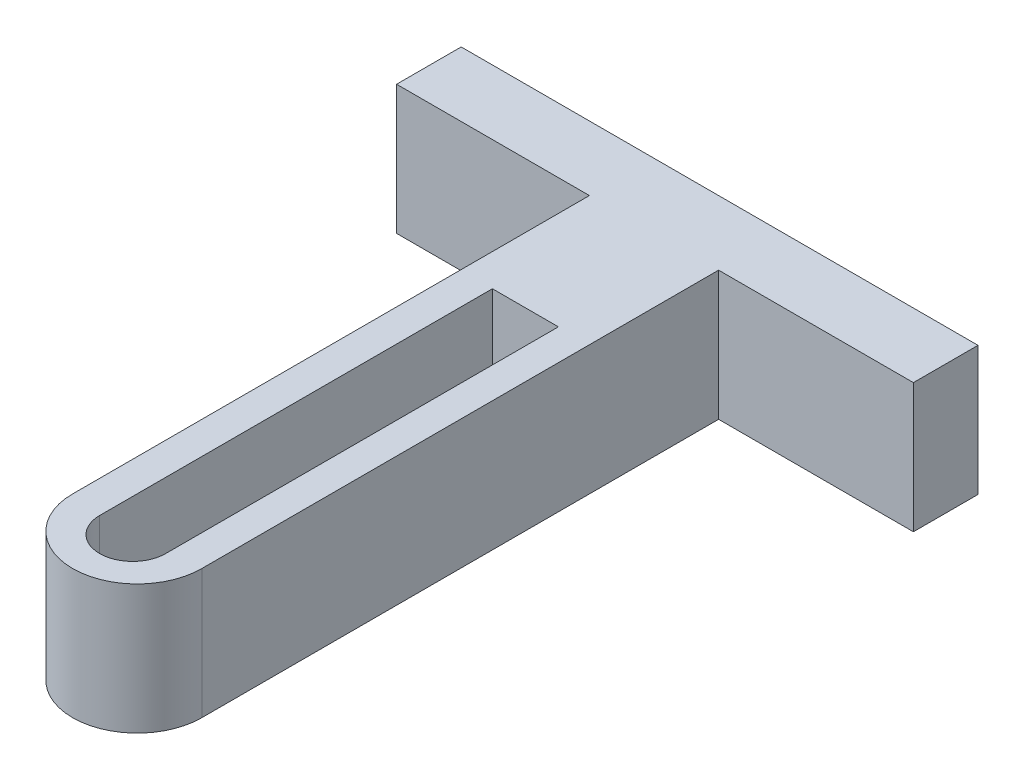
ISO-10303-21;
HEADER;
FILE_DESCRIPTION(('STEP AP214'),'2;1');
FILE_NAME('part.step','',(''),(''),'','','');
FILE_SCHEMA(('AUTOMOTIVE_DESIGN { 1 0 10303 214 1 1 1 1 }'));
ENDSEC;
DATA;
#1=APPLICATION_CONTEXT('core data for automotive mechanical design processes');
#2=APPLICATION_PROTOCOL_DEFINITION('international standard','automotive_design',2000,#1);
#3=PRODUCT_CONTEXT('',#1,'mechanical');
#4=PRODUCT('Part','Part','',(#3));
#5=PRODUCT_RELATED_PRODUCT_CATEGORY('part','',(#4));
#6=PRODUCT_DEFINITION_FORMATION('','',#4);
#7=PRODUCT_DEFINITION_CONTEXT('part definition',#1,'design');
#8=PRODUCT_DEFINITION('design','',#6,#7);
#9=PRODUCT_DEFINITION_SHAPE('','',#8);
#10=(LENGTH_UNIT() NAMED_UNIT(*) SI_UNIT(.MILLI.,.METRE.));
#11=(NAMED_UNIT(*) PLANE_ANGLE_UNIT() SI_UNIT($,.RADIAN.));
#12=(NAMED_UNIT(*) SI_UNIT($,.STERADIAN.) SOLID_ANGLE_UNIT());
#13=UNCERTAINTY_MEASURE_WITH_UNIT(LENGTH_MEASURE(1.E-05),#10,'distance_accuracy_value','');
#14=(GEOMETRIC_REPRESENTATION_CONTEXT(3) GLOBAL_UNCERTAINTY_ASSIGNED_CONTEXT((#13)) GLOBAL_UNIT_ASSIGNED_CONTEXT((#10,
#11,#12)) REPRESENTATION_CONTEXT('',''));
#15=CARTESIAN_POINT('',(0.,0.,0.));
#16=DIRECTION('',(0.,0.,1.));
#17=DIRECTION('',(1.,0.,0.));
#18=AXIS2_PLACEMENT_3D('',#15,#16,#17);
#19=CARTESIAN_POINT('',(0.,0.,6.35));
#20=DIRECTION('',(0.,0.,-1.));
#21=DIRECTION('',(-1.,0.,0.));
#22=AXIS2_PLACEMENT_3D('',#19,#20,#21);
#23=PLANE('',#22);
#24=DIRECTION('',(0.,-1.,0.));
#25=VECTOR('',#24,1.);
#26=CARTESIAN_POINT('',(18.9534844907885,12.7,6.35));
#27=LINE('',#26,#25);
#28=CARTESIAN_POINT('',(18.9534844907885,12.7,6.35));
#29=VERTEX_POINT('',#28);
#30=CARTESIAN_POINT('',(18.9534844907885,0.,6.35));
#31=VERTEX_POINT('',#30);
#32=EDGE_CURVE('E186',#29,#31,#27,.T.);
#33=ORIENTED_EDGE('',*,*,#32,.F.);
#34=DIRECTION('',(-1.,0.,0.));
#35=VECTOR('',#34,1.);
#36=CARTESIAN_POINT('',(0.,12.7,6.35));
#37=LINE('',#36,#35);
#38=CARTESIAN_POINT('',(0.,12.7,6.35));
#39=VERTEX_POINT('',#38);
#40=EDGE_CURVE('E58',#29,#39,#37,.T.);
#41=ORIENTED_EDGE('',*,*,#40,.T.);
#42=DIRECTION('',(0.,-1.,0.));
#43=VECTOR('',#42,1.);
#44=CARTESIAN_POINT('',(0.,0.,6.35));
#45=LINE('',#44,#43);
#46=CARTESIAN_POINT('',(0.,0.,6.35));
#47=VERTEX_POINT('',#46);
#48=EDGE_CURVE('E199',#39,#47,#45,.T.);
#49=ORIENTED_EDGE('',*,*,#48,.T.);
#50=DIRECTION('',(1.,0.,0.));
#51=VECTOR('',#50,1.);
#52=CARTESIAN_POINT('',(0.,0.,6.35));
#53=LINE('',#52,#51);
#54=EDGE_CURVE('E87',#47,#31,#53,.T.);
#55=ORIENTED_EDGE('',*,*,#54,.T.);
#56=EDGE_LOOP('',(#33,#41,#49,#55));
#57=FACE_BOUND('',#56,.T.);
#58=ADVANCED_FACE('F34',(#57),#23,.F.);
#59=CARTESIAN_POINT('',(0.,0.,6.35));
#60=DIRECTION('',(1.,0.,0.));
#61=DIRECTION('',(0.,0.,-1.));
#62=AXIS2_PLACEMENT_3D('',#59,#60,#61);
#63=PLANE('',#62);
#64=DIRECTION('',(0.,-1.,0.));
#65=VECTOR('',#64,1.);
#66=CARTESIAN_POINT('',(0.,0.,0.));
#67=LINE('',#66,#65);
#68=CARTESIAN_POINT('',(0.,12.7,0.));
#69=VERTEX_POINT('',#68);
#70=CARTESIAN_POINT('',(0.,0.,0.));
#71=VERTEX_POINT('',#70);
#72=EDGE_CURVE('E193',#69,#71,#67,.T.);
#73=ORIENTED_EDGE('',*,*,#72,.T.);
#74=DIRECTION('',(0.,0.,-1.));
#75=VECTOR('',#74,1.);
#76=CARTESIAN_POINT('',(0.,0.,6.35));
#77=LINE('',#76,#75);
#78=EDGE_CURVE('E11',#47,#71,#77,.T.);
#79=ORIENTED_EDGE('',*,*,#78,.F.);
#80=ORIENTED_EDGE('',*,*,#48,.F.);
#81=DIRECTION('',(0.,0.,-1.));
#82=VECTOR('',#81,1.);
#83=CARTESIAN_POINT('',(0.,12.7,6.35));
#84=LINE('',#83,#82);
#85=EDGE_CURVE('E208',#39,#69,#84,.T.);
#86=ORIENTED_EDGE('',*,*,#85,.T.);
#87=EDGE_LOOP('',(#73,#79,#80,#86));
#88=FACE_BOUND('',#87,.T.);
#89=ADVANCED_FACE('F36',(#88),#63,.F.);
#90=CARTESIAN_POINT('',(0.,0.,6.35));
#91=DIRECTION('',(0.,1.,0.));
#92=DIRECTION('',(0.,0.,1.));
#93=AXIS2_PLACEMENT_3D('',#90,#91,#92);
#94=PLANE('',#93);
#95=DIRECTION('',(1.,0.,0.));
#96=VECTOR('',#95,1.);
#97=CARTESIAN_POINT('',(0.,0.,0.));
#98=LINE('',#97,#96);
#99=CARTESIAN_POINT('',(50.8,0.,0.));
#100=VERTEX_POINT('',#99);
#101=EDGE_CURVE('E211',#71,#100,#98,.T.);
#102=ORIENTED_EDGE('',*,*,#101,.T.);
#103=DIRECTION('',(0.,0.,-1.));
#104=VECTOR('',#103,1.);
#105=CARTESIAN_POINT('',(50.8,0.,6.35));
#106=LINE('',#105,#104);
#107=CARTESIAN_POINT('',(50.8,0.,6.35));
#108=VERTEX_POINT('',#107);
#109=EDGE_CURVE('E42',#108,#100,#106,.T.);
#110=ORIENTED_EDGE('',*,*,#109,.F.);
#111=CARTESIAN_POINT('',(31.6534844907885,0.,6.35));
#112=VERTEX_POINT('',#111);
#113=EDGE_CURVE('E201',#112,#108,#53,.T.);
#114=ORIENTED_EDGE('',*,*,#113,.F.);
#115=DIRECTION('',(0.,0.,1.));
#116=VECTOR('',#115,1.);
#117=CARTESIAN_POINT('',(31.6534844907885,0.,6.35));
#118=LINE('',#117,#116);
#119=CARTESIAN_POINT('',(31.6534844907885,0.,57.15));
#120=VERTEX_POINT('',#119);
#121=EDGE_CURVE('E49',#112,#120,#118,.T.);
#122=ORIENTED_EDGE('',*,*,#121,.T.);
#123=CARTESIAN_POINT('',(25.3034844907885,0.,57.15));
#124=DIRECTION('',(0.,-1.,0.));
#125=DIRECTION('',(0.,0.,1.));
#126=AXIS2_PLACEMENT_3D('',#123,#124,#125);
#127=CIRCLE('',#126,6.35);
#128=CARTESIAN_POINT('',(18.9534844907885,0.,57.15));
#129=VERTEX_POINT('',#128);
#130=EDGE_CURVE('E180',#120,#129,#127,.T.);
#131=ORIENTED_EDGE('',*,*,#130,.T.);
#132=DIRECTION('',(0.,0.,-1.));
#133=VECTOR('',#132,1.);
#134=CARTESIAN_POINT('',(18.9534844907885,0.,6.35));
#135=LINE('',#134,#133);
#136=EDGE_CURVE('E173',#129,#31,#135,.T.);
#137=ORIENTED_EDGE('',*,*,#136,.T.);
#138=ORIENTED_EDGE('',*,*,#54,.F.);
#139=ORIENTED_EDGE('',*,*,#78,.T.);
#140=EDGE_LOOP('',(#102,#110,#114,#122,#131,#137,#138,#139));
#141=FACE_BOUND('',#140,.T.);
#142=DIRECTION('',(0.,0.,-1.));
#143=VECTOR('',#142,1.);
#144=CARTESIAN_POINT('',(22.1173265244832,0.,57.6532760296239));
#145=LINE('',#144,#143);
#146=CARTESIAN_POINT('',(22.1173265244832,0.,57.6532760296239));
#147=VERTEX_POINT('',#146);
#148=CARTESIAN_POINT('',(22.1173265244832,0.,19.05));
#149=VERTEX_POINT('',#148);
#150=EDGE_CURVE('E167',#147,#149,#145,.T.);
#151=ORIENTED_EDGE('',*,*,#150,.F.);
#152=CARTESIAN_POINT('',(25.3614055076357,0.,57.6532760296239));
#153=DIRECTION('',(0.,-1.,0.));
#154=DIRECTION('',(0.,0.,1.));
#155=AXIS2_PLACEMENT_3D('',#152,#153,#154);
#156=CIRCLE('',#155,3.24407898315258);
#157=CARTESIAN_POINT('',(28.6054844907883,0.,57.6532760296239));
#158=VERTEX_POINT('',#157);
#159=EDGE_CURVE('E141',#158,#147,#156,.T.);
#160=ORIENTED_EDGE('',*,*,#159,.F.);
#161=DIRECTION('',(0.,0.,1.));
#162=VECTOR('',#161,1.);
#163=CARTESIAN_POINT('',(28.6054844907883,0.,57.6532760296239));
#164=LINE('',#163,#162);
#165=CARTESIAN_POINT('',(28.6054844907883,0.,19.05));
#166=VERTEX_POINT('',#165);
#167=EDGE_CURVE('E158',#166,#158,#164,.T.);
#168=ORIENTED_EDGE('',*,*,#167,.F.);
#169=DIRECTION('',(1.,0.,0.));
#170=VECTOR('',#169,1.);
#171=CARTESIAN_POINT('',(22.1173265244832,0.,19.05));
#172=LINE('',#171,#170);
#173=EDGE_CURVE('E161',#149,#166,#172,.T.);
#174=ORIENTED_EDGE('',*,*,#173,.F.);
#175=EDGE_LOOP('',(#151,#160,#168,#174));
#176=FACE_BOUND('',#175,.T.);
#177=ADVANCED_FACE('F244',(#141,#176),#94,.F.);
#178=CARTESIAN_POINT('',(50.8,0.,6.35));
#179=DIRECTION('',(-1.,0.,0.));
#180=DIRECTION('',(0.,0.,1.));
#181=AXIS2_PLACEMENT_3D('',#178,#179,#180);
#182=PLANE('',#181);
#183=DIRECTION('',(0.,1.,0.));
#184=VECTOR('',#183,1.);
#185=CARTESIAN_POINT('',(50.8,0.,0.));
#186=LINE('',#185,#184);
#187=CARTESIAN_POINT('',(50.8,12.7,0.));
#188=VERTEX_POINT('',#187);
#189=EDGE_CURVE('E213',#100,#188,#186,.T.);
#190=ORIENTED_EDGE('',*,*,#189,.T.);
#191=DIRECTION('',(0.,0.,-1.));
#192=VECTOR('',#191,1.);
#193=CARTESIAN_POINT('',(50.8,12.7,6.35));
#194=LINE('',#193,#192);
#195=CARTESIAN_POINT('',(50.8,12.7,6.35));
#196=VERTEX_POINT('',#195);
#197=EDGE_CURVE('E217',#196,#188,#194,.T.);
#198=ORIENTED_EDGE('',*,*,#197,.F.);
#199=DIRECTION('',(0.,1.,0.));
#200=VECTOR('',#199,1.);
#201=CARTESIAN_POINT('',(50.8,0.,6.35));
#202=LINE('',#201,#200);
#203=EDGE_CURVE('E203',#108,#196,#202,.T.);
#204=ORIENTED_EDGE('',*,*,#203,.F.);
#205=ORIENTED_EDGE('',*,*,#109,.T.);
#206=EDGE_LOOP('',(#190,#198,#204,#205));
#207=FACE_BOUND('',#206,.T.);
#208=ADVANCED_FACE('F223',(#207),#182,.F.);
#209=CARTESIAN_POINT('',(0.,12.7,6.35));
#210=DIRECTION('',(0.,-1.,0.));
#211=DIRECTION('',(0.,0.,-1.));
#212=AXIS2_PLACEMENT_3D('',#209,#210,#211);
#213=PLANE('',#212);
#214=DIRECTION('',(-1.,0.,0.));
#215=VECTOR('',#214,1.);
#216=CARTESIAN_POINT('',(0.,12.7,0.));
#217=LINE('',#216,#215);
#218=EDGE_CURVE('E80',#188,#69,#217,.T.);
#219=ORIENTED_EDGE('',*,*,#218,.T.);
#220=ORIENTED_EDGE('',*,*,#85,.F.);
#221=ORIENTED_EDGE('',*,*,#40,.F.);
#222=DIRECTION('',(0.,0.,-1.));
#223=VECTOR('',#222,1.);
#224=CARTESIAN_POINT('',(18.9534844907885,12.7,6.35));
#225=LINE('',#224,#223);
#226=CARTESIAN_POINT('',(18.9534844907885,12.7,57.15));
#227=VERTEX_POINT('',#226);
#228=EDGE_CURVE('E177',#227,#29,#225,.T.);
#229=ORIENTED_EDGE('',*,*,#228,.F.);
#230=CARTESIAN_POINT('',(25.3034844907885,12.7,57.15));
#231=DIRECTION('',(0.,-1.,0.));
#232=DIRECTION('',(0.,0.,1.));
#233=AXIS2_PLACEMENT_3D('',#230,#231,#232);
#234=CIRCLE('',#233,6.35);
#235=CARTESIAN_POINT('',(31.6534844907885,12.7,57.15));
#236=VERTEX_POINT('',#235);
#237=EDGE_CURVE('E183',#236,#227,#234,.T.);
#238=ORIENTED_EDGE('',*,*,#237,.F.);
#239=DIRECTION('',(0.,0.,1.));
#240=VECTOR('',#239,1.);
#241=CARTESIAN_POINT('',(31.6534844907885,12.7,6.35));
#242=LINE('',#241,#240);
#243=CARTESIAN_POINT('',(31.6534844907885,12.7,6.35));
#244=VERTEX_POINT('',#243);
#245=EDGE_CURVE('E179',#244,#236,#242,.T.);
#246=ORIENTED_EDGE('',*,*,#245,.F.);
#247=EDGE_CURVE('E205',#196,#244,#37,.T.);
#248=ORIENTED_EDGE('',*,*,#247,.F.);
#249=ORIENTED_EDGE('',*,*,#197,.T.);
#250=EDGE_LOOP('',(#219,#220,#221,#229,#238,#246,#248,#249));
#251=FACE_BOUND('',#250,.T.);
#252=CARTESIAN_POINT('',(25.3614055076357,12.7,57.6532760296239));
#253=DIRECTION('',(0.,-1.,0.));
#254=DIRECTION('',(0.,0.,1.));
#255=AXIS2_PLACEMENT_3D('',#252,#253,#254);
#256=CIRCLE('',#255,3.24407898315258);
#257=CARTESIAN_POINT('',(28.6054844907883,12.7,57.6532760296239));
#258=VERTEX_POINT('',#257);
#259=CARTESIAN_POINT('',(22.1173265244832,12.7,57.6532760296239));
#260=VERTEX_POINT('',#259);
#261=EDGE_CURVE('E138',#258,#260,#256,.T.);
#262=ORIENTED_EDGE('',*,*,#261,.T.);
#263=DIRECTION('',(0.,0.,-1.));
#264=VECTOR('',#263,1.);
#265=CARTESIAN_POINT('',(22.1173265244832,12.7,57.6532760296239));
#266=LINE('',#265,#264);
#267=CARTESIAN_POINT('',(22.1173265244832,12.7,19.05));
#268=VERTEX_POINT('',#267);
#269=EDGE_CURVE('E150',#260,#268,#266,.T.);
#270=ORIENTED_EDGE('',*,*,#269,.T.);
#271=DIRECTION('',(1.,0.,0.));
#272=VECTOR('',#271,1.);
#273=CARTESIAN_POINT('',(22.1173265244832,12.7,19.05));
#274=LINE('',#273,#272);
#275=CARTESIAN_POINT('',(28.6054844907883,12.7,19.05));
#276=VERTEX_POINT('',#275);
#277=EDGE_CURVE('E154',#268,#276,#274,.T.);
#278=ORIENTED_EDGE('',*,*,#277,.T.);
#279=DIRECTION('',(0.,0.,1.));
#280=VECTOR('',#279,1.);
#281=CARTESIAN_POINT('',(28.6054844907883,12.7,57.6532760296239));
#282=LINE('',#281,#280);
#283=EDGE_CURVE('E146',#276,#258,#282,.T.);
#284=ORIENTED_EDGE('',*,*,#283,.T.);
#285=EDGE_LOOP('',(#262,#270,#278,#284));
#286=FACE_BOUND('',#285,.T.);
#287=ADVANCED_FACE('F156',(#251,#286),#213,.F.);
#288=ORIENTED_EDGE('',*,*,#247,.T.);
#289=DIRECTION('',(0.,-1.,0.));
#290=VECTOR('',#289,1.);
#291=CARTESIAN_POINT('',(31.6534844907885,12.7,6.35));
#292=LINE('',#291,#290);
#293=EDGE_CURVE('E196',#244,#112,#292,.T.);
#294=ORIENTED_EDGE('',*,*,#293,.T.);
#295=ORIENTED_EDGE('',*,*,#113,.T.);
#296=ORIENTED_EDGE('',*,*,#203,.T.);
#297=EDGE_LOOP('',(#288,#294,#295,#296));
#298=FACE_BOUND('',#297,.T.);
#299=ADVANCED_FACE('F243',(#298),#23,.F.);
#300=CARTESIAN_POINT('',(0.,0.,0.));
#301=DIRECTION('',(0.,0.,-1.));
#302=DIRECTION('',(-1.,0.,0.));
#303=AXIS2_PLACEMENT_3D('',#300,#301,#302);
#304=PLANE('',#303);
#305=ORIENTED_EDGE('',*,*,#72,.F.);
#306=ORIENTED_EDGE('',*,*,#218,.F.);
#307=ORIENTED_EDGE('',*,*,#189,.F.);
#308=ORIENTED_EDGE('',*,*,#101,.F.);
#309=EDGE_LOOP('',(#305,#306,#307,#308));
#310=FACE_BOUND('',#309,.T.);
#311=ADVANCED_FACE('F228',(#310),#304,.T.);
#312=CARTESIAN_POINT('',(18.9534844907885,12.7,6.35));
#313=DIRECTION('',(-1.,0.,0.));
#314=DIRECTION('',(0.,0.,1.));
#315=AXIS2_PLACEMENT_3D('',#312,#313,#314);
#316=PLANE('',#315);
#317=ORIENTED_EDGE('',*,*,#136,.F.);
#318=DIRECTION('',(0.,-1.,0.));
#319=VECTOR('',#318,1.);
#320=CARTESIAN_POINT('',(18.9534844907885,12.7,57.15));
#321=LINE('',#320,#319);
#322=EDGE_CURVE('E191',#227,#129,#321,.T.);
#323=ORIENTED_EDGE('',*,*,#322,.F.);
#324=ORIENTED_EDGE('',*,*,#228,.T.);
#325=ORIENTED_EDGE('',*,*,#32,.T.);
#326=EDGE_LOOP('',(#317,#323,#324,#325));
#327=FACE_BOUND('',#326,.T.);
#328=ADVANCED_FACE('F246',(#327),#316,.T.);
#329=CARTESIAN_POINT('',(25.3034844907885,12.7,57.15));
#330=DIRECTION('',(0.,-1.,0.));
#331=DIRECTION('',(0.,0.,-1.));
#332=AXIS2_PLACEMENT_3D('',#329,#330,#331);
#333=CYLINDRICAL_SURFACE('',#332,6.35);
#334=ORIENTED_EDGE('',*,*,#130,.F.);
#335=DIRECTION('',(0.,-1.,0.));
#336=VECTOR('',#335,1.);
#337=CARTESIAN_POINT('',(31.6534844907885,12.7,57.15));
#338=LINE('',#337,#336);
#339=EDGE_CURVE('E194',#236,#120,#338,.T.);
#340=ORIENTED_EDGE('',*,*,#339,.F.);
#341=ORIENTED_EDGE('',*,*,#237,.T.);
#342=ORIENTED_EDGE('',*,*,#322,.T.);
#343=EDGE_LOOP('',(#334,#340,#341,#342));
#344=FACE_BOUND('',#343,.T.);
#345=ADVANCED_FACE('F238',(#344),#333,.T.);
#346=CARTESIAN_POINT('',(31.6534844907885,12.7,6.35));
#347=DIRECTION('',(1.,0.,0.));
#348=DIRECTION('',(0.,0.,-1.));
#349=AXIS2_PLACEMENT_3D('',#346,#347,#348);
#350=PLANE('',#349);
#351=ORIENTED_EDGE('',*,*,#121,.F.);
#352=ORIENTED_EDGE('',*,*,#293,.F.);
#353=ORIENTED_EDGE('',*,*,#245,.T.);
#354=ORIENTED_EDGE('',*,*,#339,.T.);
#355=EDGE_LOOP('',(#351,#352,#353,#354));
#356=FACE_BOUND('',#355,.T.);
#357=ADVANCED_FACE('F240',(#356),#350,.T.);
#358=CARTESIAN_POINT('',(25.3614055076357,12.7,57.6532760296239));
#359=DIRECTION('',(0.,-1.,0.));
#360=DIRECTION('',(0.,0.,-1.));
#361=AXIS2_PLACEMENT_3D('',#358,#359,#360);
#362=CYLINDRICAL_SURFACE('',#361,3.24407898315258);
#363=ORIENTED_EDGE('',*,*,#159,.T.);
#364=DIRECTION('',(0.,-1.,0.));
#365=VECTOR('',#364,1.);
#366=CARTESIAN_POINT('',(22.1173265244832,12.7,57.6532760296239));
#367=LINE('',#366,#365);
#368=EDGE_CURVE('E134',#260,#147,#367,.T.);
#369=ORIENTED_EDGE('',*,*,#368,.F.);
#370=ORIENTED_EDGE('',*,*,#261,.F.);
#371=DIRECTION('',(0.,-1.,0.));
#372=VECTOR('',#371,1.);
#373=CARTESIAN_POINT('',(28.6054844907883,12.7,57.6532760296239));
#374=LINE('',#373,#372);
#375=EDGE_CURVE('E171',#258,#158,#374,.T.);
#376=ORIENTED_EDGE('',*,*,#375,.T.);
#377=EDGE_LOOP('',(#363,#369,#370,#376));
#378=FACE_BOUND('',#377,.T.);
#379=ADVANCED_FACE('F136',(#378),#362,.F.);
#380=CARTESIAN_POINT('',(28.6054844907883,12.7,57.6532760296239));
#381=DIRECTION('',(1.,0.,0.));
#382=DIRECTION('',(0.,0.,-1.));
#383=AXIS2_PLACEMENT_3D('',#380,#381,#382);
#384=PLANE('',#383);
#385=ORIENTED_EDGE('',*,*,#167,.T.);
#386=ORIENTED_EDGE('',*,*,#375,.F.);
#387=ORIENTED_EDGE('',*,*,#283,.F.);
#388=DIRECTION('',(0.,-1.,0.));
#389=VECTOR('',#388,1.);
#390=CARTESIAN_POINT('',(28.6054844907883,12.7,19.05));
#391=LINE('',#390,#389);
#392=EDGE_CURVE('E174',#276,#166,#391,.T.);
#393=ORIENTED_EDGE('',*,*,#392,.T.);
#394=EDGE_LOOP('',(#385,#386,#387,#393));
#395=FACE_BOUND('',#394,.T.);
#396=ADVANCED_FACE('F329',(#395),#384,.F.);
#397=CARTESIAN_POINT('',(22.1173265244832,12.7,19.05));
#398=DIRECTION('',(0.,0.,-1.));
#399=DIRECTION('',(-1.,0.,0.));
#400=AXIS2_PLACEMENT_3D('',#397,#398,#399);
#401=PLANE('',#400);
#402=ORIENTED_EDGE('',*,*,#173,.T.);
#403=ORIENTED_EDGE('',*,*,#392,.F.);
#404=ORIENTED_EDGE('',*,*,#277,.F.);
#405=DIRECTION('',(0.,-1.,0.));
#406=VECTOR('',#405,1.);
#407=CARTESIAN_POINT('',(22.1173265244832,12.7,19.05));
#408=LINE('',#407,#406);
#409=EDGE_CURVE('E145',#268,#149,#408,.T.);
#410=ORIENTED_EDGE('',*,*,#409,.T.);
#411=EDGE_LOOP('',(#402,#403,#404,#410));
#412=FACE_BOUND('',#411,.T.);
#413=ADVANCED_FACE('F337',(#412),#401,.F.);
#414=CARTESIAN_POINT('',(22.1173265244832,12.7,57.6532760296239));
#415=DIRECTION('',(-1.,0.,0.));
#416=DIRECTION('',(0.,0.,1.));
#417=AXIS2_PLACEMENT_3D('',#414,#415,#416);
#418=PLANE('',#417);
#419=ORIENTED_EDGE('',*,*,#150,.T.);
#420=ORIENTED_EDGE('',*,*,#409,.F.);
#421=ORIENTED_EDGE('',*,*,#269,.F.);
#422=ORIENTED_EDGE('',*,*,#368,.T.);
#423=EDGE_LOOP('',(#419,#420,#421,#422));
#424=FACE_BOUND('',#423,.T.);
#425=ADVANCED_FACE('F151',(#424),#418,.F.);
#426=CLOSED_SHELL('',(#58,#89,#177,#208,#287,#299,#311,#328,#345,#357,#379,#396,#413,#425));
#427=MANIFOLD_SOLID_BREP('B2',#426);
#428=ADVANCED_BREP_SHAPE_REPRESENTATION('',(#18,#427),#14);
#429=SHAPE_DEFINITION_REPRESENTATION(#9,#428);
ENDSEC;
END-ISO-10303-21;
